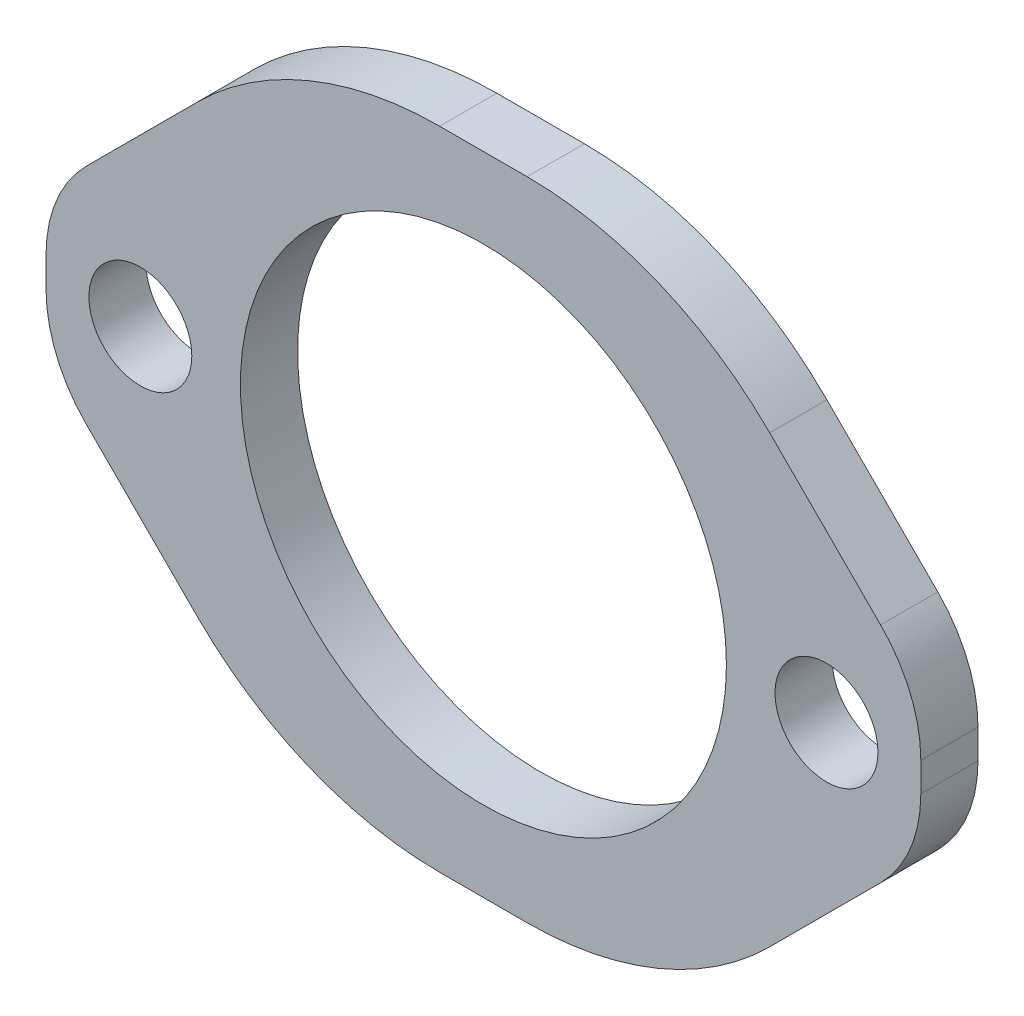
ISO-10303-21;
HEADER;
FILE_DESCRIPTION(('STEP AP214'),'2;1');
FILE_NAME('part.step','',(''),(''),'','','');
FILE_SCHEMA(('AUTOMOTIVE_DESIGN { 1 0 10303 214 1 1 1 1 }'));
ENDSEC;
DATA;
#1=APPLICATION_CONTEXT('core data for automotive mechanical design processes');
#2=APPLICATION_PROTOCOL_DEFINITION('international standard','automotive_design',2000,#1);
#3=PRODUCT_CONTEXT('',#1,'mechanical');
#4=PRODUCT('Part','Part','',(#3));
#5=PRODUCT_RELATED_PRODUCT_CATEGORY('part','',(#4));
#6=PRODUCT_DEFINITION_FORMATION('','',#4);
#7=PRODUCT_DEFINITION_CONTEXT('part definition',#1,'design');
#8=PRODUCT_DEFINITION('design','',#6,#7);
#9=PRODUCT_DEFINITION_SHAPE('','',#8);
#10=(LENGTH_UNIT() NAMED_UNIT(*) SI_UNIT(.MILLI.,.METRE.));
#11=(NAMED_UNIT(*) PLANE_ANGLE_UNIT() SI_UNIT($,.RADIAN.));
#12=(NAMED_UNIT(*) SI_UNIT($,.STERADIAN.) SOLID_ANGLE_UNIT());
#13=UNCERTAINTY_MEASURE_WITH_UNIT(LENGTH_MEASURE(1.E-05),#10,'distance_accuracy_value','');
#14=(GEOMETRIC_REPRESENTATION_CONTEXT(3) GLOBAL_UNCERTAINTY_ASSIGNED_CONTEXT((#13)) GLOBAL_UNIT_ASSIGNED_CONTEXT((#10,
#11,#12)) REPRESENTATION_CONTEXT('',''));
#15=CARTESIAN_POINT('',(0.,0.,0.));
#16=DIRECTION('',(0.,0.,1.));
#17=DIRECTION('',(1.,0.,0.));
#18=AXIS2_PLACEMENT_3D('',#15,#16,#17);
#19=CARTESIAN_POINT('',(0.,0.,5.));
#20=DIRECTION('',(0.,0.,-1.));
#21=DIRECTION('',(-1.,0.,0.));
#22=AXIS2_PLACEMENT_3D('',#19,#20,#21);
#23=PLANE('',#22);
#24=CARTESIAN_POINT('',(30.,0.,5.));
#25=DIRECTION('',(0.,0.,1.));
#26=DIRECTION('',(1.,0.,0.));
#27=AXIS2_PLACEMENT_3D('',#24,#25,#26);
#28=CIRCLE('',#27,4.5);
#29=CARTESIAN_POINT('',(34.5,0.,5.));
#30=VERTEX_POINT('',#29);
#31=EDGE_CURVE('E285',#30,#30,#28,.T.);
#32=ORIENTED_EDGE('',*,*,#31,.F.);
#33=EDGE_LOOP('',(#32));
#34=FACE_BOUND('',#33,.T.);
#35=DIRECTION('',(0.,-1.,0.));
#36=VECTOR('',#35,1.);
#37=CARTESIAN_POINT('',(-38.25,-28.25,5.));
#38=LINE('',#37,#36);
#39=CARTESIAN_POINT('',(-38.25,1.27943725152283,5.));
#40=VERTEX_POINT('',#39);
#41=CARTESIAN_POINT('',(-38.25,-1.27943725152279,5.));
#42=VERTEX_POINT('',#41);
#43=EDGE_CURVE('E271',#40,#42,#38,.T.);
#44=ORIENTED_EDGE('',*,*,#43,.T.);
#45=CARTESIAN_POINT('',(-26.25,-1.27943725152279,5.));
#46=DIRECTION('',(0.,0.,-1.));
#47=DIRECTION('',(-1.,0.,0.));
#48=AXIS2_PLACEMENT_3D('',#45,#46,#47);
#49=CIRCLE('',#48,12.);
#50=CARTESIAN_POINT('',(-34.7352813742386,-9.76471862576134,5.));
#51=VERTEX_POINT('',#50);
#52=EDGE_CURVE('E57',#42,#51,#49,.F.);
#53=ORIENTED_EDGE('',*,*,#52,.T.);
#54=DIRECTION('',(-0.707106781186546,0.707106781186549,0.));
#55=VECTOR('',#54,1.);
#56=CARTESIAN_POINT('',(-16.25,-28.25,5.));
#57=LINE('',#56,#55);
#58=CARTESIAN_POINT('',(-25.0367965644036,-19.4632034355964,5.));
#59=VERTEX_POINT('',#58);
#60=EDGE_CURVE('E198',#51,#59,#57,.F.);
#61=ORIENTED_EDGE('',*,*,#60,.T.);
#62=CARTESIAN_POINT('',(-3.82359312880711,1.74999999999999,5.));
#63=DIRECTION('',(0.,0.,-1.));
#64=DIRECTION('',(-1.,0.,0.));
#65=AXIS2_PLACEMENT_3D('',#62,#63,#64);
#66=CIRCLE('',#65,30.);
#67=CARTESIAN_POINT('',(-3.82359312880711,-28.25,5.));
#68=VERTEX_POINT('',#67);
#69=EDGE_CURVE('E234',#59,#68,#66,.F.);
#70=ORIENTED_EDGE('',*,*,#69,.T.);
#71=DIRECTION('',(1.,0.,0.));
#72=VECTOR('',#71,1.);
#73=CARTESIAN_POINT('',(-38.25,-28.25,5.));
#74=LINE('',#73,#72);
#75=CARTESIAN_POINT('',(3.82359312880709,-28.25,5.));
#76=VERTEX_POINT('',#75);
#77=EDGE_CURVE('E189',#68,#76,#74,.T.);
#78=ORIENTED_EDGE('',*,*,#77,.T.);
#79=CARTESIAN_POINT('',(3.82359312880709,1.74999999999999,5.));
#80=DIRECTION('',(0.,0.,-1.));
#81=DIRECTION('',(-1.,0.,0.));
#82=AXIS2_PLACEMENT_3D('',#79,#80,#81);
#83=CIRCLE('',#82,30.);
#84=CARTESIAN_POINT('',(25.0367965644035,-19.4632034355965,5.));
#85=VERTEX_POINT('',#84);
#86=EDGE_CURVE('E218',#76,#85,#83,.F.);
#87=ORIENTED_EDGE('',*,*,#86,.T.);
#88=DIRECTION('',(-0.707106781186549,-0.707106781186546,0.));
#89=VECTOR('',#88,1.);
#90=CARTESIAN_POINT('',(38.25,-6.24999999999998,5.));
#91=LINE('',#90,#89);
#92=CARTESIAN_POINT('',(34.7352813742386,-9.76471862576142,5.));
#93=VERTEX_POINT('',#92);
#94=EDGE_CURVE('E168',#85,#93,#91,.F.);
#95=ORIENTED_EDGE('',*,*,#94,.T.);
#96=CARTESIAN_POINT('',(26.25,-1.27943725152284,5.));
#97=DIRECTION('',(0.,0.,-1.));
#98=DIRECTION('',(-1.,0.,0.));
#99=AXIS2_PLACEMENT_3D('',#96,#97,#98);
#100=CIRCLE('',#99,12.);
#101=CARTESIAN_POINT('',(38.25,-1.27943725152284,5.));
#102=VERTEX_POINT('',#101);
#103=EDGE_CURVE('E253',#93,#102,#100,.F.);
#104=ORIENTED_EDGE('',*,*,#103,.T.);
#105=DIRECTION('',(0.,1.,0.));
#106=VECTOR('',#105,1.);
#107=CARTESIAN_POINT('',(38.25,-28.25,5.));
#108=LINE('',#107,#106);
#109=CARTESIAN_POINT('',(38.25,1.27943725152281,5.));
#110=VERTEX_POINT('',#109);
#111=EDGE_CURVE('E185',#102,#110,#108,.T.);
#112=ORIENTED_EDGE('',*,*,#111,.T.);
#113=CARTESIAN_POINT('',(26.25,1.27943725152281,5.));
#114=DIRECTION('',(0.,0.,-1.));
#115=DIRECTION('',(-1.,0.,0.));
#116=AXIS2_PLACEMENT_3D('',#113,#114,#115);
#117=CIRCLE('',#116,12.);
#118=CARTESIAN_POINT('',(34.7352813742386,9.76471862576136,5.));
#119=VERTEX_POINT('',#118);
#120=EDGE_CURVE('E239',#110,#119,#117,.F.);
#121=ORIENTED_EDGE('',*,*,#120,.T.);
#122=DIRECTION('',(0.707106781186546,-0.707106781186549,0.));
#123=VECTOR('',#122,1.);
#124=CARTESIAN_POINT('',(16.25,28.25,5.));
#125=LINE('',#124,#123);
#126=CARTESIAN_POINT('',(25.0367965644036,19.4632034355964,5.));
#127=VERTEX_POINT('',#126);
#128=EDGE_CURVE('E188',#119,#127,#125,.F.);
#129=ORIENTED_EDGE('',*,*,#128,.T.);
#130=CARTESIAN_POINT('',(3.82359312880715,-1.75,5.));
#131=DIRECTION('',(0.,0.,-1.));
#132=DIRECTION('',(-1.,0.,0.));
#133=AXIS2_PLACEMENT_3D('',#130,#131,#132);
#134=CIRCLE('',#133,30.);
#135=CARTESIAN_POINT('',(3.82359312880715,28.25,5.));
#136=VERTEX_POINT('',#135);
#137=EDGE_CURVE('E205',#127,#136,#134,.F.);
#138=ORIENTED_EDGE('',*,*,#137,.T.);
#139=DIRECTION('',(-1.,0.,0.));
#140=VECTOR('',#139,1.);
#141=CARTESIAN_POINT('',(-38.25,28.25,5.));
#142=LINE('',#141,#140);
#143=CARTESIAN_POINT('',(-3.82359312880709,28.25,5.));
#144=VERTEX_POINT('',#143);
#145=EDGE_CURVE('E167',#136,#144,#142,.T.);
#146=ORIENTED_EDGE('',*,*,#145,.T.);
#147=CARTESIAN_POINT('',(-3.82359312880709,-1.75,5.));
#148=DIRECTION('',(0.,0.,-1.));
#149=DIRECTION('',(-1.,0.,0.));
#150=AXIS2_PLACEMENT_3D('',#147,#148,#149);
#151=CIRCLE('',#150,30.);
#152=CARTESIAN_POINT('',(-25.0367965644035,19.4632034355965,5.));
#153=VERTEX_POINT('',#152);
#154=EDGE_CURVE('E209',#144,#153,#151,.F.);
#155=ORIENTED_EDGE('',*,*,#154,.T.);
#156=DIRECTION('',(0.707106781186549,0.707106781186546,0.));
#157=VECTOR('',#156,1.);
#158=CARTESIAN_POINT('',(-38.25,6.24999999999998,5.));
#159=LINE('',#158,#157);
#160=CARTESIAN_POINT('',(-34.7352813742386,9.76471862576141,5.));
#161=VERTEX_POINT('',#160);
#162=EDGE_CURVE('E193',#153,#161,#159,.F.);
#163=ORIENTED_EDGE('',*,*,#162,.T.);
#164=CARTESIAN_POINT('',(-26.25,1.27943725152283,5.));
#165=DIRECTION('',(0.,0.,-1.));
#166=DIRECTION('',(-1.,0.,0.));
#167=AXIS2_PLACEMENT_3D('',#164,#165,#166);
#168=CIRCLE('',#167,12.);
#169=EDGE_CURVE('E262',#161,#40,#168,.F.);
#170=ORIENTED_EDGE('',*,*,#169,.T.);
#171=EDGE_LOOP('',(#44,#53,#61,#70,#78,#87,#95,#104,#112,#121,#129,#138,#146,#155,#163,#170));
#172=FACE_BOUND('',#171,.T.);
#173=CARTESIAN_POINT('',(0.,0.,5.));
#174=DIRECTION('',(0.,0.,1.));
#175=DIRECTION('',(1.,0.,0.));
#176=AXIS2_PLACEMENT_3D('',#173,#174,#175);
#177=CIRCLE('',#176,21.25);
#178=CARTESIAN_POINT('',(21.25,0.,5.));
#179=VERTEX_POINT('',#178);
#180=EDGE_CURVE('E180',#179,#179,#177,.T.);
#181=ORIENTED_EDGE('',*,*,#180,.F.);
#182=EDGE_LOOP('',(#181));
#183=FACE_BOUND('',#182,.T.);
#184=CARTESIAN_POINT('',(-30.,0.,5.));
#185=DIRECTION('',(0.,0.,1.));
#186=DIRECTION('',(1.,0.,0.));
#187=AXIS2_PLACEMENT_3D('',#184,#185,#186);
#188=CIRCLE('',#187,4.5);
#189=CARTESIAN_POINT('',(-25.5,0.,5.));
#190=VERTEX_POINT('',#189);
#191=EDGE_CURVE('E291',#190,#190,#188,.T.);
#192=ORIENTED_EDGE('',*,*,#191,.F.);
#193=EDGE_LOOP('',(#192));
#194=FACE_BOUND('',#193,.T.);
#195=ADVANCED_FACE('F35',(#34,#172,#183,#194),#23,.F.);
#196=CARTESIAN_POINT('',(0.,0.,0.));
#197=DIRECTION('',(0.,0.,-1.));
#198=DIRECTION('',(-1.,0.,0.));
#199=AXIS2_PLACEMENT_3D('',#196,#197,#198);
#200=PLANE('',#199);
#201=CARTESIAN_POINT('',(30.,0.,0.));
#202=DIRECTION('',(0.,0.,1.));
#203=DIRECTION('',(1.,0.,0.));
#204=AXIS2_PLACEMENT_3D('',#201,#202,#203);
#205=CIRCLE('',#204,4.5);
#206=CARTESIAN_POINT('',(34.5,0.,0.));
#207=VERTEX_POINT('',#206);
#208=EDGE_CURVE('E288',#207,#207,#205,.T.);
#209=ORIENTED_EDGE('',*,*,#208,.T.);
#210=EDGE_LOOP('',(#209));
#211=FACE_BOUND('',#210,.T.);
#212=DIRECTION('',(0.707106781186546,-0.707106781186549,0.));
#213=VECTOR('',#212,1.);
#214=CARTESIAN_POINT('',(-22.25,-22.2499999999999,0.));
#215=LINE('',#214,#213);
#216=CARTESIAN_POINT('',(-25.0367965644036,-19.4632034355964,0.));
#217=VERTEX_POINT('',#216);
#218=CARTESIAN_POINT('',(-34.7352813742386,-9.76471862576134,0.));
#219=VERTEX_POINT('',#218);
#220=EDGE_CURVE('E196',#217,#219,#215,.F.);
#221=ORIENTED_EDGE('',*,*,#220,.T.);
#222=CARTESIAN_POINT('',(-26.25,-1.27943725152279,0.));
#223=DIRECTION('',(0.,0.,-1.));
#224=DIRECTION('',(-1.,0.,0.));
#225=AXIS2_PLACEMENT_3D('',#222,#223,#224);
#226=CIRCLE('',#225,12.);
#227=CARTESIAN_POINT('',(-38.25,-1.27943725152279,0.));
#228=VERTEX_POINT('',#227);
#229=EDGE_CURVE('E11',#219,#228,#226,.T.);
#230=ORIENTED_EDGE('',*,*,#229,.T.);
#231=DIRECTION('',(0.,-1.,0.));
#232=VECTOR('',#231,1.);
#233=CARTESIAN_POINT('',(-38.25,-28.25,0.));
#234=LINE('',#233,#232);
#235=CARTESIAN_POINT('',(-38.25,1.27943725152283,0.));
#236=VERTEX_POINT('',#235);
#237=EDGE_CURVE('E174',#236,#228,#234,.T.);
#238=ORIENTED_EDGE('',*,*,#237,.F.);
#239=CARTESIAN_POINT('',(-26.25,1.27943725152283,0.));
#240=DIRECTION('',(0.,0.,-1.));
#241=DIRECTION('',(-1.,0.,0.));
#242=AXIS2_PLACEMENT_3D('',#239,#240,#241);
#243=CIRCLE('',#242,12.);
#244=CARTESIAN_POINT('',(-34.7352813742386,9.76471862576141,0.));
#245=VERTEX_POINT('',#244);
#246=EDGE_CURVE('E258',#236,#245,#243,.T.);
#247=ORIENTED_EDGE('',*,*,#246,.T.);
#248=DIRECTION('',(-0.707106781186549,-0.707106781186546,0.));
#249=VECTOR('',#248,1.);
#250=CARTESIAN_POINT('',(-22.2499999999999,22.25,0.));
#251=LINE('',#250,#249);
#252=CARTESIAN_POINT('',(-25.0367965644035,19.4632034355965,0.));
#253=VERTEX_POINT('',#252);
#254=EDGE_CURVE('E191',#245,#253,#251,.F.);
#255=ORIENTED_EDGE('',*,*,#254,.T.);
#256=CARTESIAN_POINT('',(-3.82359312880709,-1.75,0.));
#257=DIRECTION('',(0.,0.,-1.));
#258=DIRECTION('',(-1.,0.,0.));
#259=AXIS2_PLACEMENT_3D('',#256,#257,#258);
#260=CIRCLE('',#259,30.);
#261=CARTESIAN_POINT('',(-3.82359312880709,28.25,0.));
#262=VERTEX_POINT('',#261);
#263=EDGE_CURVE('E173',#253,#262,#260,.T.);
#264=ORIENTED_EDGE('',*,*,#263,.T.);
#265=DIRECTION('',(-1.,0.,0.));
#266=VECTOR('',#265,1.);
#267=CARTESIAN_POINT('',(-38.25,28.25,0.));
#268=LINE('',#267,#266);
#269=CARTESIAN_POINT('',(3.82359312880715,28.25,0.));
#270=VERTEX_POINT('',#269);
#271=EDGE_CURVE('E164',#270,#262,#268,.T.);
#272=ORIENTED_EDGE('',*,*,#271,.F.);
#273=CARTESIAN_POINT('',(3.82359312880715,-1.75,0.));
#274=DIRECTION('',(0.,0.,-1.));
#275=DIRECTION('',(-1.,0.,0.));
#276=AXIS2_PLACEMENT_3D('',#273,#274,#275);
#277=CIRCLE('',#276,30.);
#278=CARTESIAN_POINT('',(25.0367965644036,19.4632034355964,0.));
#279=VERTEX_POINT('',#278);
#280=EDGE_CURVE('E147',#270,#279,#277,.T.);
#281=ORIENTED_EDGE('',*,*,#280,.T.);
#282=DIRECTION('',(-0.707106781186546,0.707106781186549,0.));
#283=VECTOR('',#282,1.);
#284=CARTESIAN_POINT('',(22.25,22.25,0.));
#285=LINE('',#284,#283);
#286=CARTESIAN_POINT('',(34.7352813742386,9.76471862576136,0.));
#287=VERTEX_POINT('',#286);
#288=EDGE_CURVE('E186',#279,#287,#285,.F.);
#289=ORIENTED_EDGE('',*,*,#288,.T.);
#290=CARTESIAN_POINT('',(26.25,1.27943725152281,0.));
#291=DIRECTION('',(0.,0.,-1.));
#292=DIRECTION('',(-1.,0.,0.));
#293=AXIS2_PLACEMENT_3D('',#290,#291,#292);
#294=CIRCLE('',#293,12.);
#295=CARTESIAN_POINT('',(38.25,1.27943725152281,0.));
#296=VERTEX_POINT('',#295);
#297=EDGE_CURVE('E243',#287,#296,#294,.T.);
#298=ORIENTED_EDGE('',*,*,#297,.T.);
#299=DIRECTION('',(0.,1.,0.));
#300=VECTOR('',#299,1.);
#301=CARTESIAN_POINT('',(38.25,-28.25,0.));
#302=LINE('',#301,#300);
#303=CARTESIAN_POINT('',(38.25,-1.27943725152284,0.));
#304=VERTEX_POINT('',#303);
#305=EDGE_CURVE('E175',#304,#296,#302,.T.);
#306=ORIENTED_EDGE('',*,*,#305,.F.);
#307=CARTESIAN_POINT('',(26.25,-1.27943725152284,0.));
#308=DIRECTION('',(0.,0.,-1.));
#309=DIRECTION('',(-1.,0.,0.));
#310=AXIS2_PLACEMENT_3D('',#307,#308,#309);
#311=CIRCLE('',#310,12.);
#312=CARTESIAN_POINT('',(34.7352813742386,-9.76471862576141,0.));
#313=VERTEX_POINT('',#312);
#314=EDGE_CURVE('E249',#304,#313,#311,.T.);
#315=ORIENTED_EDGE('',*,*,#314,.T.);
#316=DIRECTION('',(0.707106781186549,0.707106781186546,0.));
#317=VECTOR('',#316,1.);
#318=CARTESIAN_POINT('',(22.2499999999999,-22.25,0.));
#319=LINE('',#318,#317);
#320=CARTESIAN_POINT('',(25.0367965644035,-19.4632034355965,0.));
#321=VERTEX_POINT('',#320);
#322=EDGE_CURVE('E200',#313,#321,#319,.F.);
#323=ORIENTED_EDGE('',*,*,#322,.T.);
#324=CARTESIAN_POINT('',(3.82359312880709,1.74999999999999,0.));
#325=DIRECTION('',(0.,0.,-1.));
#326=DIRECTION('',(-1.,0.,0.));
#327=AXIS2_PLACEMENT_3D('',#324,#325,#326);
#328=CIRCLE('',#327,30.);
#329=CARTESIAN_POINT('',(3.82359312880709,-28.25,0.));
#330=VERTEX_POINT('',#329);
#331=EDGE_CURVE('E223',#321,#330,#328,.T.);
#332=ORIENTED_EDGE('',*,*,#331,.T.);
#333=DIRECTION('',(1.,0.,0.));
#334=VECTOR('',#333,1.);
#335=CARTESIAN_POINT('',(-38.25,-28.25,0.));
#336=LINE('',#335,#334);
#337=CARTESIAN_POINT('',(-3.82359312880711,-28.25,0.));
#338=VERTEX_POINT('',#337);
#339=EDGE_CURVE('E178',#338,#330,#336,.T.);
#340=ORIENTED_EDGE('',*,*,#339,.F.);
#341=CARTESIAN_POINT('',(-3.82359312880711,1.74999999999999,0.));
#342=DIRECTION('',(0.,0.,-1.));
#343=DIRECTION('',(-1.,0.,0.));
#344=AXIS2_PLACEMENT_3D('',#341,#342,#343);
#345=CIRCLE('',#344,30.);
#346=EDGE_CURVE('E229',#338,#217,#345,.T.);
#347=ORIENTED_EDGE('',*,*,#346,.T.);
#348=EDGE_LOOP('',(#221,#230,#238,#247,#255,#264,#272,#281,#289,#298,#306,#315,#323,#332,#340,#347));
#349=FACE_BOUND('',#348,.T.);
#350=CARTESIAN_POINT('',(0.,0.,0.));
#351=DIRECTION('',(0.,0.,1.));
#352=DIRECTION('',(1.,0.,0.));
#353=AXIS2_PLACEMENT_3D('',#350,#351,#352);
#354=CIRCLE('',#353,21.25);
#355=CARTESIAN_POINT('',(21.25,0.,0.));
#356=VERTEX_POINT('',#355);
#357=EDGE_CURVE('E282',#356,#356,#354,.T.);
#358=ORIENTED_EDGE('',*,*,#357,.T.);
#359=EDGE_LOOP('',(#358));
#360=FACE_BOUND('',#359,.T.);
#361=CARTESIAN_POINT('',(-30.,0.,0.));
#362=DIRECTION('',(0.,0.,1.));
#363=DIRECTION('',(1.,0.,0.));
#364=AXIS2_PLACEMENT_3D('',#361,#362,#363);
#365=CIRCLE('',#364,4.5);
#366=CARTESIAN_POINT('',(-25.5,0.,0.));
#367=VERTEX_POINT('',#366);
#368=EDGE_CURVE('E294',#367,#367,#365,.T.);
#369=ORIENTED_EDGE('',*,*,#368,.T.);
#370=EDGE_LOOP('',(#369));
#371=FACE_BOUND('',#370,.T.);
#372=ADVANCED_FACE('F170',(#211,#349,#360,#371),#200,.T.);
#373=CARTESIAN_POINT('',(38.25,-28.25,5.));
#374=DIRECTION('',(-1.,0.,0.));
#375=DIRECTION('',(0.,0.,1.));
#376=AXIS2_PLACEMENT_3D('',#373,#374,#375);
#377=PLANE('',#376);
#378=ORIENTED_EDGE('',*,*,#111,.F.);
#379=DIRECTION('',(0.,0.,1.));
#380=VECTOR('',#379,1.);
#381=CARTESIAN_POINT('',(38.25,-1.27943725152284,0.));
#382=LINE('',#381,#380);
#383=EDGE_CURVE('E246',#102,#304,#382,.F.);
#384=ORIENTED_EDGE('',*,*,#383,.T.);
#385=ORIENTED_EDGE('',*,*,#305,.T.);
#386=DIRECTION('',(0.,0.,-1.));
#387=VECTOR('',#386,1.);
#388=CARTESIAN_POINT('',(38.25,1.27943725152281,5.));
#389=LINE('',#388,#387);
#390=EDGE_CURVE('E236',#296,#110,#389,.F.);
#391=ORIENTED_EDGE('',*,*,#390,.T.);
#392=EDGE_LOOP('',(#378,#384,#385,#391));
#393=FACE_BOUND('',#392,.T.);
#394=ADVANCED_FACE('F309',(#393),#377,.F.);
#395=CARTESIAN_POINT('',(-38.25,28.25,5.));
#396=DIRECTION('',(0.,-1.,0.));
#397=DIRECTION('',(0.,0.,-1.));
#398=AXIS2_PLACEMENT_3D('',#395,#396,#397);
#399=PLANE('',#398);
#400=ORIENTED_EDGE('',*,*,#271,.T.);
#401=DIRECTION('',(0.,0.,-1.));
#402=VECTOR('',#401,1.);
#403=CARTESIAN_POINT('',(-3.82359312880709,28.25,5.));
#404=LINE('',#403,#402);
#405=EDGE_CURVE('E207',#262,#144,#404,.F.);
#406=ORIENTED_EDGE('',*,*,#405,.T.);
#407=ORIENTED_EDGE('',*,*,#145,.F.);
#408=DIRECTION('',(0.,0.,1.));
#409=VECTOR('',#408,1.);
#410=CARTESIAN_POINT('',(3.82359312880715,28.25,0.));
#411=LINE('',#410,#409);
#412=EDGE_CURVE('E151',#136,#270,#411,.F.);
#413=ORIENTED_EDGE('',*,*,#412,.T.);
#414=EDGE_LOOP('',(#400,#406,#407,#413));
#415=FACE_BOUND('',#414,.T.);
#416=ADVANCED_FACE('F162',(#415),#399,.F.);
#417=CARTESIAN_POINT('',(-38.25,-28.25,5.));
#418=DIRECTION('',(1.,0.,0.));
#419=DIRECTION('',(0.,0.,-1.));
#420=AXIS2_PLACEMENT_3D('',#417,#418,#419);
#421=PLANE('',#420);
#422=ORIENTED_EDGE('',*,*,#237,.T.);
#423=DIRECTION('',(0.,0.,-1.));
#424=VECTOR('',#423,1.);
#425=CARTESIAN_POINT('',(-38.25,-1.27943725152279,5.));
#426=LINE('',#425,#424);
#427=EDGE_CURVE('E264',#228,#42,#426,.F.);
#428=ORIENTED_EDGE('',*,*,#427,.T.);
#429=ORIENTED_EDGE('',*,*,#43,.F.);
#430=DIRECTION('',(0.,0.,1.));
#431=VECTOR('',#430,1.);
#432=CARTESIAN_POINT('',(-38.25,1.27943725152283,0.));
#433=LINE('',#432,#431);
#434=EDGE_CURVE('E255',#40,#236,#433,.F.);
#435=ORIENTED_EDGE('',*,*,#434,.T.);
#436=EDGE_LOOP('',(#422,#428,#429,#435));
#437=FACE_BOUND('',#436,.T.);
#438=ADVANCED_FACE('F270',(#437),#421,.F.);
#439=CARTESIAN_POINT('',(-38.25,-28.25,5.));
#440=DIRECTION('',(0.,1.,0.));
#441=DIRECTION('',(0.,0.,1.));
#442=AXIS2_PLACEMENT_3D('',#439,#440,#441);
#443=PLANE('',#442);
#444=ORIENTED_EDGE('',*,*,#77,.F.);
#445=DIRECTION('',(0.,0.,1.));
#446=VECTOR('',#445,1.);
#447=CARTESIAN_POINT('',(-3.82359312880711,-28.25,0.));
#448=LINE('',#447,#446);
#449=EDGE_CURVE('E226',#68,#338,#448,.F.);
#450=ORIENTED_EDGE('',*,*,#449,.T.);
#451=ORIENTED_EDGE('',*,*,#339,.T.);
#452=DIRECTION('',(0.,0.,-1.));
#453=VECTOR('',#452,1.);
#454=CARTESIAN_POINT('',(3.82359312880709,-28.25,5.));
#455=LINE('',#454,#453);
#456=EDGE_CURVE('E215',#330,#76,#455,.F.);
#457=ORIENTED_EDGE('',*,*,#456,.T.);
#458=EDGE_LOOP('',(#444,#450,#451,#457));
#459=FACE_BOUND('',#458,.T.);
#460=ADVANCED_FACE('F317',(#459),#443,.F.);
#461=CARTESIAN_POINT('',(0.,0.,5.));
#462=DIRECTION('',(0.,0.,-1.));
#463=DIRECTION('',(-1.,0.,0.));
#464=AXIS2_PLACEMENT_3D('',#461,#462,#463);
#465=CYLINDRICAL_SURFACE('',#464,21.25);
#466=ORIENTED_EDGE('',*,*,#180,.T.);
#467=EDGE_LOOP('',(#466));
#468=FACE_BOUND('',#467,.T.);
#469=ORIENTED_EDGE('',*,*,#357,.F.);
#470=EDGE_LOOP('',(#469));
#471=FACE_BOUND('',#470,.T.);
#472=ADVANCED_FACE('F314',(#468,#471),#465,.F.);
#473=CARTESIAN_POINT('',(30.,0.,5.));
#474=DIRECTION('',(0.,0.,-1.));
#475=DIRECTION('',(-1.,0.,0.));
#476=AXIS2_PLACEMENT_3D('',#473,#474,#475);
#477=CYLINDRICAL_SURFACE('',#476,4.5);
#478=ORIENTED_EDGE('',*,*,#31,.T.);
#479=EDGE_LOOP('',(#478));
#480=FACE_BOUND('',#479,.T.);
#481=ORIENTED_EDGE('',*,*,#208,.F.);
#482=EDGE_LOOP('',(#481));
#483=FACE_BOUND('',#482,.T.);
#484=ADVANCED_FACE('F506',(#480,#483),#477,.F.);
#485=CARTESIAN_POINT('',(-30.,0.,5.));
#486=DIRECTION('',(0.,0.,-1.));
#487=DIRECTION('',(-1.,0.,0.));
#488=AXIS2_PLACEMENT_3D('',#485,#486,#487);
#489=CYLINDRICAL_SURFACE('',#488,4.5);
#490=ORIENTED_EDGE('',*,*,#191,.T.);
#491=EDGE_LOOP('',(#490));
#492=FACE_BOUND('',#491,.T.);
#493=ORIENTED_EDGE('',*,*,#368,.F.);
#494=EDGE_LOOP('',(#493));
#495=FACE_BOUND('',#494,.T.);
#496=ADVANCED_FACE('F300',(#492,#495),#489,.F.);
#497=CARTESIAN_POINT('',(16.25,28.25,5.));
#498=DIRECTION('',(-0.707106781186549,-0.707106781186546,0.));
#499=DIRECTION('',(0.,0.,-1.));
#500=AXIS2_PLACEMENT_3D('',#497,#498,#499);
#501=PLANE('',#500);
#502=ORIENTED_EDGE('',*,*,#128,.F.);
#503=DIRECTION('',(0.,0.,1.));
#504=VECTOR('',#503,1.);
#505=CARTESIAN_POINT('',(34.7352813742386,9.76471862576136,0.));
#506=LINE('',#505,#504);
#507=EDGE_CURVE('E241',#119,#287,#506,.F.);
#508=ORIENTED_EDGE('',*,*,#507,.T.);
#509=ORIENTED_EDGE('',*,*,#288,.F.);
#510=DIRECTION('',(0.,0.,-1.));
#511=VECTOR('',#510,1.);
#512=CARTESIAN_POINT('',(25.0367965644036,19.4632034355964,5.));
#513=LINE('',#512,#511);
#514=EDGE_CURVE('E153',#279,#127,#513,.F.);
#515=ORIENTED_EDGE('',*,*,#514,.T.);
#516=EDGE_LOOP('',(#502,#508,#509,#515));
#517=FACE_BOUND('',#516,.T.);
#518=ADVANCED_FACE('F328',(#517),#501,.F.);
#519=CARTESIAN_POINT('',(-38.25,6.24999999999998,5.));
#520=DIRECTION('',(0.707106781186546,-0.707106781186549,0.));
#521=DIRECTION('',(0.,0.,-1.));
#522=AXIS2_PLACEMENT_3D('',#519,#520,#521);
#523=PLANE('',#522);
#524=ORIENTED_EDGE('',*,*,#254,.F.);
#525=DIRECTION('',(0.,0.,-1.));
#526=VECTOR('',#525,1.);
#527=CARTESIAN_POINT('',(-34.7352813742386,9.76471862576141,5.));
#528=LINE('',#527,#526);
#529=EDGE_CURVE('E260',#245,#161,#528,.F.);
#530=ORIENTED_EDGE('',*,*,#529,.T.);
#531=ORIENTED_EDGE('',*,*,#162,.F.);
#532=DIRECTION('',(0.,0.,1.));
#533=VECTOR('',#532,1.);
#534=CARTESIAN_POINT('',(-25.0367965644035,19.4632034355965,0.));
#535=LINE('',#534,#533);
#536=EDGE_CURVE('E211',#153,#253,#535,.F.);
#537=ORIENTED_EDGE('',*,*,#536,.T.);
#538=EDGE_LOOP('',(#524,#530,#531,#537));
#539=FACE_BOUND('',#538,.T.);
#540=ADVANCED_FACE('F331',(#539),#523,.F.);
#541=CARTESIAN_POINT('',(-16.25,-28.25,5.));
#542=DIRECTION('',(0.707106781186549,0.707106781186546,0.));
#543=DIRECTION('',(0.,0.,-1.));
#544=AXIS2_PLACEMENT_3D('',#541,#542,#543);
#545=PLANE('',#544);
#546=ORIENTED_EDGE('',*,*,#60,.F.);
#547=DIRECTION('',(0.,0.,1.));
#548=VECTOR('',#547,1.);
#549=CARTESIAN_POINT('',(-34.7352813742386,-9.76471862576134,0.));
#550=LINE('',#549,#548);
#551=EDGE_CURVE('E43',#51,#219,#550,.F.);
#552=ORIENTED_EDGE('',*,*,#551,.T.);
#553=ORIENTED_EDGE('',*,*,#220,.F.);
#554=DIRECTION('',(0.,0.,-1.));
#555=VECTOR('',#554,1.);
#556=CARTESIAN_POINT('',(-25.0367965644036,-19.4632034355964,5.));
#557=LINE('',#556,#555);
#558=EDGE_CURVE('E231',#217,#59,#557,.F.);
#559=ORIENTED_EDGE('',*,*,#558,.T.);
#560=EDGE_LOOP('',(#546,#552,#553,#559));
#561=FACE_BOUND('',#560,.T.);
#562=ADVANCED_FACE('F335',(#561),#545,.F.);
#563=CARTESIAN_POINT('',(38.25,-6.24999999999998,5.));
#564=DIRECTION('',(-0.707106781186546,0.707106781186549,0.));
#565=DIRECTION('',(0.,0.,-1.));
#566=AXIS2_PLACEMENT_3D('',#563,#564,#565);
#567=PLANE('',#566);
#568=ORIENTED_EDGE('',*,*,#322,.F.);
#569=DIRECTION('',(0.,0.,-1.));
#570=VECTOR('',#569,1.);
#571=CARTESIAN_POINT('',(34.7352813742386,-9.76471862576142,5.));
#572=LINE('',#571,#570);
#573=EDGE_CURVE('E251',#313,#93,#572,.F.);
#574=ORIENTED_EDGE('',*,*,#573,.T.);
#575=ORIENTED_EDGE('',*,*,#94,.F.);
#576=DIRECTION('',(0.,0.,1.));
#577=VECTOR('',#576,1.);
#578=CARTESIAN_POINT('',(25.0367965644035,-19.4632034355965,0.));
#579=LINE('',#578,#577);
#580=EDGE_CURVE('E220',#85,#321,#579,.F.);
#581=ORIENTED_EDGE('',*,*,#580,.T.);
#582=EDGE_LOOP('',(#568,#574,#575,#581));
#583=FACE_BOUND('',#582,.T.);
#584=ADVANCED_FACE('F339',(#583),#567,.F.);
#585=CARTESIAN_POINT('',(3.82359312880715,-1.75,5.));
#586=DIRECTION('',(0.,0.,-1.));
#587=DIRECTION('',(-1.,0.,0.));
#588=AXIS2_PLACEMENT_3D('',#585,#586,#587);
#589=CYLINDRICAL_SURFACE('',#588,30.);
#590=ORIENTED_EDGE('',*,*,#137,.F.);
#591=ORIENTED_EDGE('',*,*,#514,.F.);
#592=ORIENTED_EDGE('',*,*,#280,.F.);
#593=ORIENTED_EDGE('',*,*,#412,.F.);
#594=EDGE_LOOP('',(#590,#591,#592,#593));
#595=FACE_BOUND('',#594,.T.);
#596=ADVANCED_FACE('F150',(#595),#589,.T.);
#597=CARTESIAN_POINT('',(-3.82359312880709,-1.75,5.));
#598=DIRECTION('',(0.,0.,1.));
#599=DIRECTION('',(1.,0.,0.));
#600=AXIS2_PLACEMENT_3D('',#597,#598,#599);
#601=CYLINDRICAL_SURFACE('',#600,30.);
#602=ORIENTED_EDGE('',*,*,#263,.F.);
#603=ORIENTED_EDGE('',*,*,#536,.F.);
#604=ORIENTED_EDGE('',*,*,#154,.F.);
#605=ORIENTED_EDGE('',*,*,#405,.F.);
#606=EDGE_LOOP('',(#602,#603,#604,#605));
#607=FACE_BOUND('',#606,.T.);
#608=ADVANCED_FACE('F345',(#607),#601,.T.);
#609=CARTESIAN_POINT('',(3.82359312880709,1.74999999999999,5.));
#610=DIRECTION('',(0.,0.,1.));
#611=DIRECTION('',(1.,0.,0.));
#612=AXIS2_PLACEMENT_3D('',#609,#610,#611);
#613=CYLINDRICAL_SURFACE('',#612,30.);
#614=ORIENTED_EDGE('',*,*,#331,.F.);
#615=ORIENTED_EDGE('',*,*,#580,.F.);
#616=ORIENTED_EDGE('',*,*,#86,.F.);
#617=ORIENTED_EDGE('',*,*,#456,.F.);
#618=EDGE_LOOP('',(#614,#615,#616,#617));
#619=FACE_BOUND('',#618,.T.);
#620=ADVANCED_FACE('F348',(#619),#613,.T.);
#621=CARTESIAN_POINT('',(-3.82359312880711,1.74999999999999,5.));
#622=DIRECTION('',(0.,0.,-1.));
#623=DIRECTION('',(-1.,0.,0.));
#624=AXIS2_PLACEMENT_3D('',#621,#622,#623);
#625=CYLINDRICAL_SURFACE('',#624,30.);
#626=ORIENTED_EDGE('',*,*,#69,.F.);
#627=ORIENTED_EDGE('',*,*,#558,.F.);
#628=ORIENTED_EDGE('',*,*,#346,.F.);
#629=ORIENTED_EDGE('',*,*,#449,.F.);
#630=EDGE_LOOP('',(#626,#627,#628,#629));
#631=FACE_BOUND('',#630,.T.);
#632=ADVANCED_FACE('F352',(#631),#625,.T.);
#633=CARTESIAN_POINT('',(26.25,1.27943725152281,5.));
#634=DIRECTION('',(0.,0.,1.));
#635=DIRECTION('',(1.,0.,0.));
#636=AXIS2_PLACEMENT_3D('',#633,#634,#635);
#637=CYLINDRICAL_SURFACE('',#636,12.);
#638=ORIENTED_EDGE('',*,*,#297,.F.);
#639=ORIENTED_EDGE('',*,*,#507,.F.);
#640=ORIENTED_EDGE('',*,*,#120,.F.);
#641=ORIENTED_EDGE('',*,*,#390,.F.);
#642=EDGE_LOOP('',(#638,#639,#640,#641));
#643=FACE_BOUND('',#642,.T.);
#644=ADVANCED_FACE('F356',(#643),#637,.T.);
#645=CARTESIAN_POINT('',(26.25,-1.27943725152284,5.));
#646=DIRECTION('',(0.,0.,-1.));
#647=DIRECTION('',(-1.,0.,0.));
#648=AXIS2_PLACEMENT_3D('',#645,#646,#647);
#649=CYLINDRICAL_SURFACE('',#648,12.);
#650=ORIENTED_EDGE('',*,*,#103,.F.);
#651=ORIENTED_EDGE('',*,*,#573,.F.);
#652=ORIENTED_EDGE('',*,*,#314,.F.);
#653=ORIENTED_EDGE('',*,*,#383,.F.);
#654=EDGE_LOOP('',(#650,#651,#652,#653));
#655=FACE_BOUND('',#654,.T.);
#656=ADVANCED_FACE('F360',(#655),#649,.T.);
#657=CARTESIAN_POINT('',(-26.25,1.27943725152283,5.));
#658=DIRECTION('',(0.,0.,-1.));
#659=DIRECTION('',(-1.,0.,0.));
#660=AXIS2_PLACEMENT_3D('',#657,#658,#659);
#661=CYLINDRICAL_SURFACE('',#660,12.);
#662=ORIENTED_EDGE('',*,*,#169,.F.);
#663=ORIENTED_EDGE('',*,*,#529,.F.);
#664=ORIENTED_EDGE('',*,*,#246,.F.);
#665=ORIENTED_EDGE('',*,*,#434,.F.);
#666=EDGE_LOOP('',(#662,#663,#664,#665));
#667=FACE_BOUND('',#666,.T.);
#668=ADVANCED_FACE('F363',(#667),#661,.T.);
#669=CARTESIAN_POINT('',(-26.25,-1.27943725152279,5.));
#670=DIRECTION('',(0.,0.,1.));
#671=DIRECTION('',(1.,0.,0.));
#672=AXIS2_PLACEMENT_3D('',#669,#670,#671);
#673=CYLINDRICAL_SURFACE('',#672,12.);
#674=ORIENTED_EDGE('',*,*,#229,.F.);
#675=ORIENTED_EDGE('',*,*,#551,.F.);
#676=ORIENTED_EDGE('',*,*,#52,.F.);
#677=ORIENTED_EDGE('',*,*,#427,.F.);
#678=EDGE_LOOP('',(#674,#675,#676,#677));
#679=FACE_BOUND('',#678,.T.);
#680=ADVANCED_FACE('F37',(#679),#673,.T.);
#681=CLOSED_SHELL('',(#195,#372,#394,#416,#438,#460,#472,#484,#496,#518,#540,#562,#584,#596,
#608,#620,#632,#644,#656,#668,#680));
#682=MANIFOLD_SOLID_BREP('B2',#681);
#683=ADVANCED_BREP_SHAPE_REPRESENTATION('',(#18,#682),#14);
#684=SHAPE_DEFINITION_REPRESENTATION(#9,#683);
ENDSEC;
END-ISO-10303-21;
